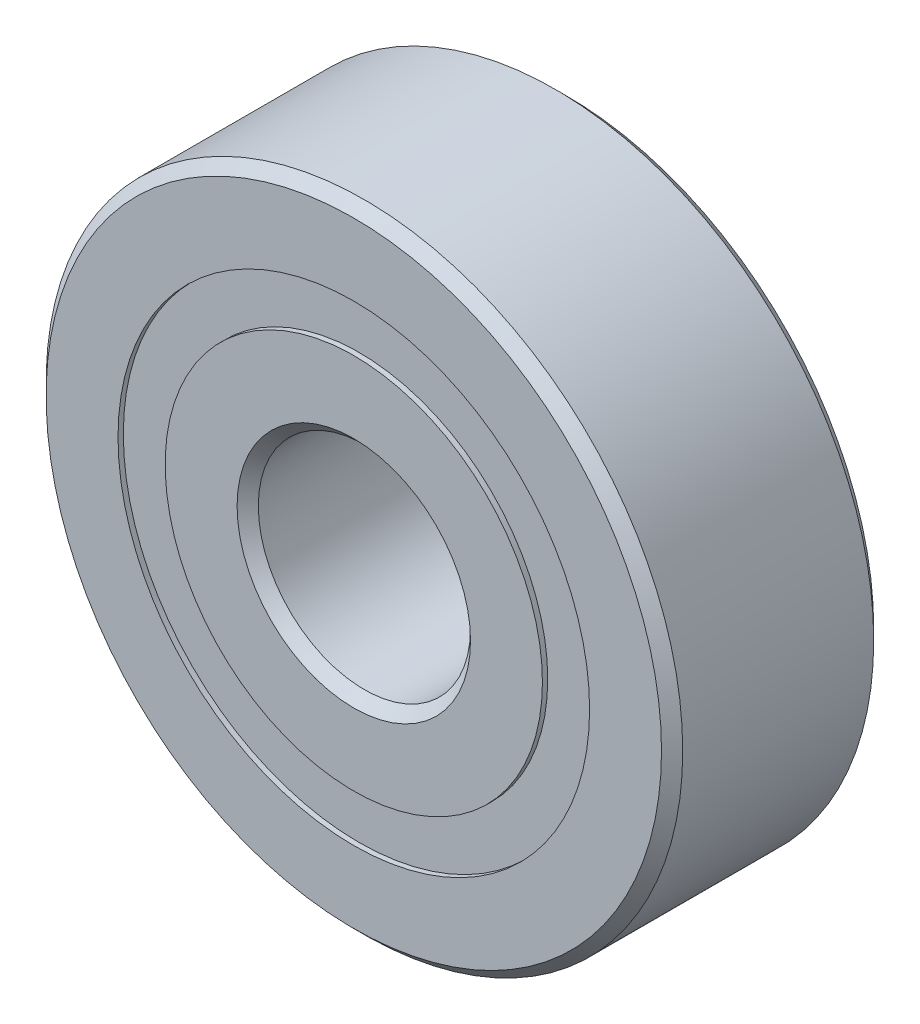
ISO-10303-21;
HEADER;
FILE_DESCRIPTION(('STEP AP214'),'2;1');
FILE_NAME('part.step','',(''),(''),'','','');
FILE_SCHEMA(('AUTOMOTIVE_DESIGN { 1 0 10303 214 1 1 1 1 }'));
ENDSEC;
DATA;
#1=APPLICATION_CONTEXT('core data for automotive mechanical design processes');
#2=APPLICATION_PROTOCOL_DEFINITION('international standard','automotive_design',2000,#1);
#3=PRODUCT_CONTEXT('',#1,'mechanical');
#4=PRODUCT('Part','Part','',(#3));
#5=PRODUCT_RELATED_PRODUCT_CATEGORY('part','',(#4));
#6=PRODUCT_DEFINITION_FORMATION('','',#4);
#7=PRODUCT_DEFINITION_CONTEXT('part definition',#1,'design');
#8=PRODUCT_DEFINITION('design','',#6,#7);
#9=PRODUCT_DEFINITION_SHAPE('','',#8);
#10=(LENGTH_UNIT() NAMED_UNIT(*) SI_UNIT(.MILLI.,.METRE.));
#11=(NAMED_UNIT(*) PLANE_ANGLE_UNIT() SI_UNIT($,.RADIAN.));
#12=(NAMED_UNIT(*) SI_UNIT($,.STERADIAN.) SOLID_ANGLE_UNIT());
#13=UNCERTAINTY_MEASURE_WITH_UNIT(LENGTH_MEASURE(1.E-05),#10,'distance_accuracy_value','');
#14=(GEOMETRIC_REPRESENTATION_CONTEXT(3) GLOBAL_UNCERTAINTY_ASSIGNED_CONTEXT((#13)) GLOBAL_UNIT_ASSIGNED_CONTEXT((#10,
#11,#12)) REPRESENTATION_CONTEXT('',''));
#15=CARTESIAN_POINT('',(0.,0.,0.));
#16=DIRECTION('',(0.,0.,1.));
#17=DIRECTION('',(1.,0.,0.));
#18=AXIS2_PLACEMENT_3D('',#15,#16,#17);
#19=CARTESIAN_POINT('',(0.,4.44444444444444,-0.993807989999908));
#20=DIRECTION('',(0.,0.,-1.));
#21=DIRECTION('',(-1.,0.,0.));
#22=AXIS2_PLACEMENT_3D('',#19,#20,#21);
#23=PLANE('',#22);
#24=CARTESIAN_POINT('',(0.,0.,-0.993807989999909));
#25=DIRECTION('',(0.,0.,1.));
#26=DIRECTION('',(1.,0.,0.));
#27=AXIS2_PLACEMENT_3D('',#24,#25,#26);
#28=CIRCLE('',#27,3.55555555555556);
#29=CARTESIAN_POINT('',(3.55555555555556,0.,-0.993807989999909));
#30=VERTEX_POINT('',#29);
#31=EDGE_CURVE('E11',#30,#30,#28,.T.);
#32=ORIENTED_EDGE('',*,*,#31,.F.);
#33=EDGE_LOOP('',(#32));
#34=FACE_BOUND('',#33,.T.);
#35=CARTESIAN_POINT('',(0.,0.,-0.993807989999908));
#36=DIRECTION('',(0.,0.,1.));
#37=DIRECTION('',(1.,0.,0.));
#38=AXIS2_PLACEMENT_3D('',#35,#36,#37);
#39=CIRCLE('',#38,4.44444444444444);
#40=CARTESIAN_POINT('',(4.44444444444444,0.,-0.993807989999908));
#41=VERTEX_POINT('',#40);
#42=EDGE_CURVE('E55',#41,#41,#39,.T.);
#43=ORIENTED_EDGE('',*,*,#42,.T.);
#44=EDGE_LOOP('',(#43));
#45=FACE_BOUND('',#44,.T.);
#46=ADVANCED_FACE('F41',(#34,#45),#23,.F.);
#47=CARTESIAN_POINT('',(0.,0.,2.));
#48=DIRECTION('',(0.,0.,1.));
#49=DIRECTION('',(1.,0.,0.));
#50=AXIS2_PLACEMENT_3D('',#47,#48,#49);
#51=CYLINDRICAL_SURFACE('',#50,3.55555555555556);
#52=CARTESIAN_POINT('',(0.,0.,-1.90000000000001));
#53=DIRECTION('',(0.,0.,1.));
#54=DIRECTION('',(1.,0.,0.));
#55=AXIS2_PLACEMENT_3D('',#52,#53,#54);
#56=CIRCLE('',#55,3.55555555555556);
#57=CARTESIAN_POINT('',(3.55555555555556,0.,-1.90000000000001));
#58=VERTEX_POINT('',#57);
#59=EDGE_CURVE('E47',#58,#58,#56,.T.);
#60=ORIENTED_EDGE('',*,*,#59,.F.);
#61=EDGE_LOOP('',(#60));
#62=FACE_BOUND('',#61,.T.);
#63=ORIENTED_EDGE('',*,*,#31,.T.);
#64=EDGE_LOOP('',(#63));
#65=FACE_BOUND('',#64,.T.);
#66=ADVANCED_FACE('F70',(#62,#65),#51,.F.);
#67=CARTESIAN_POINT('',(0.,4.44444444444444,-1.90000000000001));
#68=DIRECTION('',(0.,0.,1.));
#69=DIRECTION('',(1.,0.,0.));
#70=AXIS2_PLACEMENT_3D('',#67,#68,#69);
#71=PLANE('',#70);
#72=CARTESIAN_POINT('',(0.,0.,-1.90000000000001));
#73=DIRECTION('',(0.,0.,1.));
#74=DIRECTION('',(1.,0.,0.));
#75=AXIS2_PLACEMENT_3D('',#72,#73,#74);
#76=CIRCLE('',#75,4.44444444444444);
#77=CARTESIAN_POINT('',(4.44444444444444,0.,-1.90000000000001));
#78=VERTEX_POINT('',#77);
#79=EDGE_CURVE('E51',#78,#78,#76,.T.);
#80=ORIENTED_EDGE('',*,*,#79,.F.);
#81=EDGE_LOOP('',(#80));
#82=FACE_BOUND('',#81,.T.);
#83=ORIENTED_EDGE('',*,*,#59,.T.);
#84=EDGE_LOOP('',(#83));
#85=FACE_BOUND('',#84,.T.);
#86=ADVANCED_FACE('F65',(#82,#85),#71,.F.);
#87=CARTESIAN_POINT('',(0.,0.,2.));
#88=DIRECTION('',(0.,0.,1.));
#89=DIRECTION('',(1.,0.,0.));
#90=AXIS2_PLACEMENT_3D('',#87,#88,#89);
#91=CYLINDRICAL_SURFACE('',#90,4.44444444444444);
#92=ORIENTED_EDGE('',*,*,#42,.F.);
#93=EDGE_LOOP('',(#92));
#94=FACE_BOUND('',#93,.T.);
#95=ORIENTED_EDGE('',*,*,#79,.T.);
#96=EDGE_LOOP('',(#95));
#97=FACE_BOUND('',#96,.T.);
#98=ADVANCED_FACE('F62',(#94,#97),#91,.T.);
#99=CLOSED_SHELL('',(#46,#66,#86,#98));
#100=MANIFOLD_SOLID_BREP('B2',#99);
#101=CARTESIAN_POINT('',(0.,4.44444444444444,1.9));
#102=DIRECTION('',(0.,0.,-1.));
#103=DIRECTION('',(-1.,0.,0.));
#104=AXIS2_PLACEMENT_3D('',#101,#102,#103);
#105=PLANE('',#104);
#106=CARTESIAN_POINT('',(0.,0.,1.9));
#107=DIRECTION('',(0.,0.,1.));
#108=DIRECTION('',(1.,0.,0.));
#109=AXIS2_PLACEMENT_3D('',#106,#107,#108);
#110=CIRCLE('',#109,3.55555555555556);
#111=CARTESIAN_POINT('',(3.55555555555556,0.,1.9));
#112=VERTEX_POINT('',#111);
#113=EDGE_CURVE('E40',#112,#112,#110,.T.);
#114=ORIENTED_EDGE('',*,*,#113,.F.);
#115=EDGE_LOOP('',(#114));
#116=FACE_BOUND('',#115,.T.);
#117=CARTESIAN_POINT('',(0.,0.,1.9));
#118=DIRECTION('',(0.,0.,1.));
#119=DIRECTION('',(1.,0.,0.));
#120=AXIS2_PLACEMENT_3D('',#117,#118,#119);
#121=CIRCLE('',#120,4.44444444444444);
#122=CARTESIAN_POINT('',(4.44444444444444,0.,1.9));
#123=VERTEX_POINT('',#122);
#124=EDGE_CURVE('E122',#123,#123,#121,.T.);
#125=ORIENTED_EDGE('',*,*,#124,.T.);
#126=EDGE_LOOP('',(#125));
#127=FACE_BOUND('',#126,.T.);
#128=ADVANCED_FACE('F108',(#116,#127),#105,.F.);
#129=CARTESIAN_POINT('',(0.,0.,2.));
#130=DIRECTION('',(0.,0.,1.));
#131=DIRECTION('',(1.,0.,0.));
#132=AXIS2_PLACEMENT_3D('',#129,#130,#131);
#133=CYLINDRICAL_SURFACE('',#132,3.55555555555556);
#134=CARTESIAN_POINT('',(0.,0.,0.993807989999899));
#135=DIRECTION('',(0.,0.,1.));
#136=DIRECTION('',(1.,0.,0.));
#137=AXIS2_PLACEMENT_3D('',#134,#135,#136);
#138=CIRCLE('',#137,3.55555555555556);
#139=CARTESIAN_POINT('',(3.55555555555556,0.,0.993807989999899));
#140=VERTEX_POINT('',#139);
#141=EDGE_CURVE('E114',#140,#140,#138,.T.);
#142=ORIENTED_EDGE('',*,*,#141,.F.);
#143=EDGE_LOOP('',(#142));
#144=FACE_BOUND('',#143,.T.);
#145=ORIENTED_EDGE('',*,*,#113,.T.);
#146=EDGE_LOOP('',(#145));
#147=FACE_BOUND('',#146,.T.);
#148=ADVANCED_FACE('F137',(#144,#147),#133,.F.);
#149=CARTESIAN_POINT('',(0.,4.44444444444444,0.993807989999899));
#150=DIRECTION('',(0.,0.,1.));
#151=DIRECTION('',(1.,0.,0.));
#152=AXIS2_PLACEMENT_3D('',#149,#150,#151);
#153=PLANE('',#152);
#154=CARTESIAN_POINT('',(0.,0.,0.993807989999899));
#155=DIRECTION('',(0.,0.,1.));
#156=DIRECTION('',(1.,0.,0.));
#157=AXIS2_PLACEMENT_3D('',#154,#155,#156);
#158=CIRCLE('',#157,4.44444444444444);
#159=CARTESIAN_POINT('',(4.44444444444444,0.,0.993807989999899));
#160=VERTEX_POINT('',#159);
#161=EDGE_CURVE('E118',#160,#160,#158,.T.);
#162=ORIENTED_EDGE('',*,*,#161,.F.);
#163=EDGE_LOOP('',(#162));
#164=FACE_BOUND('',#163,.T.);
#165=ORIENTED_EDGE('',*,*,#141,.T.);
#166=EDGE_LOOP('',(#165));
#167=FACE_BOUND('',#166,.T.);
#168=ADVANCED_FACE('F132',(#164,#167),#153,.F.);
#169=CARTESIAN_POINT('',(0.,0.,2.));
#170=DIRECTION('',(0.,0.,1.));
#171=DIRECTION('',(1.,0.,0.));
#172=AXIS2_PLACEMENT_3D('',#169,#170,#171);
#173=CYLINDRICAL_SURFACE('',#172,4.44444444444444);
#174=ORIENTED_EDGE('',*,*,#124,.F.);
#175=EDGE_LOOP('',(#174));
#176=FACE_BOUND('',#175,.T.);
#177=ORIENTED_EDGE('',*,*,#161,.T.);
#178=EDGE_LOOP('',(#177));
#179=FACE_BOUND('',#178,.T.);
#180=ADVANCED_FACE('F129',(#176,#179),#173,.T.);
#181=CLOSED_SHELL('',(#128,#148,#168,#180));
#182=MANIFOLD_SOLID_BREP('B6',#181);
#183=CARTESIAN_POINT('',(-1.99999999999996,3.46410161513778,0.));
#184=DIRECTION('',(0.,0.,1.));
#185=DIRECTION('',(-0.499999999999989,0.866025403784445,0.));
#186=AXIS2_PLACEMENT_3D('',#183,#184,#185);
#187=SPHERICAL_SURFACE('',#186,0.993807989999899);
#188=CARTESIAN_POINT('',(-1.99999999999996,3.46410161513778,0.993807989999896));
#189=VERTEX_POINT('',#188);
#190=VERTEX_LOOP('',#189);
#191=FACE_BOUND('',#190,.T.);
#192=ADVANCED_FACE('F175',(#191),#187,.T.);
#193=CLOSED_SHELL('',(#192));
#194=MANIFOLD_SOLID_BREP('B35',#193);
#195=CARTESIAN_POINT('',(-3.46410161513773,2.00000000000004,0.));
#196=DIRECTION('',(0.,0.,1.));
#197=DIRECTION('',(-0.866025403784433,0.50000000000001,0.));
#198=AXIS2_PLACEMENT_3D('',#195,#196,#197);
#199=SPHERICAL_SURFACE('',#198,0.993807989999899);
#200=CARTESIAN_POINT('',(-3.46410161513773,2.00000000000004,0.993807989999896));
#201=VERTEX_POINT('',#200);
#202=VERTEX_LOOP('',#201);
#203=FACE_BOUND('',#202,.T.);
#204=ADVANCED_FACE('F206',(#203),#199,.T.);
#205=CLOSED_SHELL('',(#204));
#206=MANIFOLD_SOLID_BREP('B104',#205);
#207=CARTESIAN_POINT('',(-4.,0.,0.));
#208=DIRECTION('',(0.,0.,1.));
#209=DIRECTION('',(-1.,0.,0.));
#210=AXIS2_PLACEMENT_3D('',#207,#208,#209);
#211=SPHERICAL_SURFACE('',#210,0.993807989999899);
#212=CARTESIAN_POINT('',(-4.,0.,0.993807989999896));
#213=VERTEX_POINT('',#212);
#214=VERTEX_LOOP('',#213);
#215=FACE_BOUND('',#214,.T.);
#216=ADVANCED_FACE('F237',(#215),#211,.T.);
#217=CLOSED_SHELL('',(#216));
#218=MANIFOLD_SOLID_BREP('B171',#217);
#219=CARTESIAN_POINT('',(-3.46410161513777,-1.99999999999997,0.));
#220=DIRECTION('',(0.,0.,1.));
#221=DIRECTION('',(-0.866025403784443,-0.499999999999992,0.));
#222=AXIS2_PLACEMENT_3D('',#219,#220,#221);
#223=SPHERICAL_SURFACE('',#222,0.993807989999899);
#224=CARTESIAN_POINT('',(-3.46410161513777,-1.99999999999997,0.993807989999896));
#225=VERTEX_POINT('',#224);
#226=VERTEX_LOOP('',#225);
#227=FACE_BOUND('',#226,.T.);
#228=ADVANCED_FACE('F268',(#227),#223,.T.);
#229=CLOSED_SHELL('',(#228));
#230=MANIFOLD_SOLID_BREP('B202',#229);
#231=CARTESIAN_POINT('',(-2.00000000000003,-3.46410161513774,0.));
#232=DIRECTION('',(0.,0.,1.));
#233=DIRECTION('',(-0.500000000000007,-0.866025403784435,0.));
#234=AXIS2_PLACEMENT_3D('',#231,#232,#233);
#235=SPHERICAL_SURFACE('',#234,0.993807989999899);
#236=CARTESIAN_POINT('',(-2.00000000000003,-3.46410161513774,0.993807989999896));
#237=VERTEX_POINT('',#236);
#238=VERTEX_LOOP('',#237);
#239=FACE_BOUND('',#238,.T.);
#240=ADVANCED_FACE('F299',(#239),#235,.T.);
#241=CLOSED_SHELL('',(#240));
#242=MANIFOLD_SOLID_BREP('B233',#241);
#243=CARTESIAN_POINT('',(0.,-4.,0.));
#244=DIRECTION('',(0.,0.,1.));
#245=DIRECTION('',(0.,-1.,0.));
#246=AXIS2_PLACEMENT_3D('',#243,#244,#245);
#247=SPHERICAL_SURFACE('',#246,0.993807989999899);
#248=CARTESIAN_POINT('',(0.,-4.,0.993807989999896));
#249=VERTEX_POINT('',#248);
#250=VERTEX_LOOP('',#249);
#251=FACE_BOUND('',#250,.T.);
#252=ADVANCED_FACE('F330',(#251),#247,.T.);
#253=CLOSED_SHELL('',(#252));
#254=MANIFOLD_SOLID_BREP('B264',#253);
#255=CARTESIAN_POINT('',(1.99999999999998,-3.46410161513777,0.));
#256=DIRECTION('',(0.,0.,1.));
#257=DIRECTION('',(0.499999999999995,-0.866025403784442,0.));
#258=AXIS2_PLACEMENT_3D('',#255,#256,#257);
#259=SPHERICAL_SURFACE('',#258,0.993807989999899);
#260=CARTESIAN_POINT('',(1.99999999999998,-3.46410161513777,0.993807989999896));
#261=VERTEX_POINT('',#260);
#262=VERTEX_LOOP('',#261);
#263=FACE_BOUND('',#262,.T.);
#264=ADVANCED_FACE('F361',(#263),#259,.T.);
#265=CLOSED_SHELL('',(#264));
#266=MANIFOLD_SOLID_BREP('B295',#265);
#267=CARTESIAN_POINT('',(3.46410161513775,-2.00000000000002,0.));
#268=DIRECTION('',(0.,0.,1.));
#269=DIRECTION('',(0.866025403784436,-0.500000000000004,0.));
#270=AXIS2_PLACEMENT_3D('',#267,#268,#269);
#271=SPHERICAL_SURFACE('',#270,0.993807989999899);
#272=CARTESIAN_POINT('',(3.46410161513775,-2.00000000000002,0.993807989999896));
#273=VERTEX_POINT('',#272);
#274=VERTEX_LOOP('',#273);
#275=FACE_BOUND('',#274,.T.);
#276=ADVANCED_FACE('F392',(#275),#271,.T.);
#277=CLOSED_SHELL('',(#276));
#278=MANIFOLD_SOLID_BREP('B326',#277);
#279=CARTESIAN_POINT('',(4.,0.,0.));
#280=DIRECTION('',(0.,0.,1.));
#281=DIRECTION('',(1.,0.,0.));
#282=AXIS2_PLACEMENT_3D('',#279,#280,#281);
#283=SPHERICAL_SURFACE('',#282,0.993807989999899);
#284=CARTESIAN_POINT('',(4.,0.,0.993807989999896));
#285=VERTEX_POINT('',#284);
#286=VERTEX_LOOP('',#285);
#287=FACE_BOUND('',#286,.T.);
#288=ADVANCED_FACE('F423',(#287),#283,.T.);
#289=CLOSED_SHELL('',(#288));
#290=MANIFOLD_SOLID_BREP('B357',#289);
#291=CARTESIAN_POINT('',(3.46410161513776,1.99999999999999,0.));
#292=DIRECTION('',(0.,0.,1.));
#293=DIRECTION('',(0.86602540378444,0.499999999999998,0.));
#294=AXIS2_PLACEMENT_3D('',#291,#292,#293);
#295=SPHERICAL_SURFACE('',#294,0.993807989999899);
#296=CARTESIAN_POINT('',(3.46410161513776,1.99999999999999,0.993807989999896));
#297=VERTEX_POINT('',#296);
#298=VERTEX_LOOP('',#297);
#299=FACE_BOUND('',#298,.T.);
#300=ADVANCED_FACE('F454',(#299),#295,.T.);
#301=CLOSED_SHELL('',(#300));
#302=MANIFOLD_SOLID_BREP('B388',#301);
#303=CARTESIAN_POINT('',(2.,3.46410161513775,0.));
#304=DIRECTION('',(0.,0.,1.));
#305=DIRECTION('',(0.500000000000001,0.866025403784438,0.));
#306=AXIS2_PLACEMENT_3D('',#303,#304,#305);
#307=SPHERICAL_SURFACE('',#306,0.993807989999899);
#308=CARTESIAN_POINT('',(2.,3.46410161513775,0.993807989999896));
#309=VERTEX_POINT('',#308);
#310=VERTEX_LOOP('',#309);
#311=FACE_BOUND('',#310,.T.);
#312=ADVANCED_FACE('F485',(#311),#307,.T.);
#313=CLOSED_SHELL('',(#312));
#314=MANIFOLD_SOLID_BREP('B419',#313);
#315=CARTESIAN_POINT('',(0.,4.,0.));
#316=DIRECTION('',(0.,0.,1.));
#317=DIRECTION('',(0.,1.,0.));
#318=AXIS2_PLACEMENT_3D('',#315,#316,#317);
#319=SPHERICAL_SURFACE('',#318,0.993807989999899);
#320=CARTESIAN_POINT('',(0.,4.,0.993807989999896));
#321=VERTEX_POINT('',#320);
#322=VERTEX_LOOP('',#321);
#323=FACE_BOUND('',#322,.T.);
#324=ADVANCED_FACE('F518',(#323),#319,.T.);
#325=CLOSED_SHELL('',(#324));
#326=MANIFOLD_SOLID_BREP('B450',#325);
#327=CARTESIAN_POINT('',(0.,3.55555555555556,2.));
#328=DIRECTION('',(0.,0.,-1.));
#329=DIRECTION('',(-1.,0.,0.));
#330=AXIS2_PLACEMENT_3D('',#327,#328,#329);
#331=PLANE('',#330);
#332=CARTESIAN_POINT('',(0.,0.,2.));
#333=DIRECTION('',(0.,0.,1.));
#334=DIRECTION('',(1.,0.,0.));
#335=AXIS2_PLACEMENT_3D('',#332,#333,#334);
#336=CIRCLE('',#335,2.2);
#337=CARTESIAN_POINT('',(2.2,0.,2.));
#338=VERTEX_POINT('',#337);
#339=EDGE_CURVE('E517',#338,#338,#336,.T.);
#340=ORIENTED_EDGE('',*,*,#339,.F.);
#341=EDGE_LOOP('',(#340));
#342=FACE_BOUND('',#341,.T.);
#343=CARTESIAN_POINT('',(0.,0.,2.));
#344=DIRECTION('',(0.,0.,1.));
#345=DIRECTION('',(1.,0.,0.));
#346=AXIS2_PLACEMENT_3D('',#343,#344,#345);
#347=CIRCLE('',#346,3.55555555555556);
#348=CARTESIAN_POINT('',(3.55555555555556,0.,2.));
#349=VERTEX_POINT('',#348);
#350=EDGE_CURVE('E565',#349,#349,#347,.T.);
#351=ORIENTED_EDGE('',*,*,#350,.T.);
#352=EDGE_LOOP('',(#351));
#353=FACE_BOUND('',#352,.T.);
#354=ADVANCED_FACE('F537',(#342,#353),#331,.F.);
#355=CARTESIAN_POINT('',(0.,0.,2.));
#356=DIRECTION('',(0.,0.,1.));
#357=DIRECTION('',(1.,0.,0.));
#358=AXIS2_PLACEMENT_3D('',#355,#356,#357);
#359=CONICAL_SURFACE('',#358,2.2,0.785398163397448);
#360=CARTESIAN_POINT('',(0.,0.,1.8));
#361=DIRECTION('',(0.,0.,1.));
#362=DIRECTION('',(1.,0.,0.));
#363=AXIS2_PLACEMENT_3D('',#360,#361,#362);
#364=CIRCLE('',#363,2.);
#365=CARTESIAN_POINT('',(2.,0.,1.8));
#366=VERTEX_POINT('',#365);
#367=EDGE_CURVE('E543',#366,#366,#364,.T.);
#368=ORIENTED_EDGE('',*,*,#367,.F.);
#369=EDGE_LOOP('',(#368));
#370=FACE_BOUND('',#369,.T.);
#371=ORIENTED_EDGE('',*,*,#339,.T.);
#372=EDGE_LOOP('',(#371));
#373=FACE_BOUND('',#372,.T.);
#374=ADVANCED_FACE('F602',(#370,#373),#359,.F.);
#375=CARTESIAN_POINT('',(0.,0.,2.));
#376=DIRECTION('',(0.,0.,1.));
#377=DIRECTION('',(1.,0.,0.));
#378=AXIS2_PLACEMENT_3D('',#375,#376,#377);
#379=CYLINDRICAL_SURFACE('',#378,2.);
#380=CARTESIAN_POINT('',(0.,0.,-1.8));
#381=DIRECTION('',(0.,0.,1.));
#382=DIRECTION('',(1.,0.,0.));
#383=AXIS2_PLACEMENT_3D('',#380,#381,#382);
#384=CIRCLE('',#383,2.);
#385=CARTESIAN_POINT('',(2.,0.,-1.8));
#386=VERTEX_POINT('',#385);
#387=EDGE_CURVE('E547',#386,#386,#384,.T.);
#388=ORIENTED_EDGE('',*,*,#387,.F.);
#389=EDGE_LOOP('',(#388));
#390=FACE_BOUND('',#389,.T.);
#391=ORIENTED_EDGE('',*,*,#367,.T.);
#392=EDGE_LOOP('',(#391));
#393=FACE_BOUND('',#392,.T.);
#394=ADVANCED_FACE('F597',(#390,#393),#379,.F.);
#395=CARTESIAN_POINT('',(0.,0.,-1.8));
#396=DIRECTION('',(0.,0.,-1.));
#397=DIRECTION('',(-1.,0.,0.));
#398=AXIS2_PLACEMENT_3D('',#395,#396,#397);
#399=CONICAL_SURFACE('',#398,2.,0.785398163397448);
#400=CARTESIAN_POINT('',(0.,0.,-2.));
#401=DIRECTION('',(0.,0.,1.));
#402=DIRECTION('',(1.,0.,0.));
#403=AXIS2_PLACEMENT_3D('',#400,#401,#402);
#404=CIRCLE('',#403,2.2);
#405=CARTESIAN_POINT('',(2.2,0.,-2.));
#406=VERTEX_POINT('',#405);
#407=EDGE_CURVE('E551',#406,#406,#404,.T.);
#408=ORIENTED_EDGE('',*,*,#407,.F.);
#409=EDGE_LOOP('',(#408));
#410=FACE_BOUND('',#409,.T.);
#411=ORIENTED_EDGE('',*,*,#387,.T.);
#412=EDGE_LOOP('',(#411));
#413=FACE_BOUND('',#412,.T.);
#414=ADVANCED_FACE('F591',(#410,#413),#399,.F.);
#415=CARTESIAN_POINT('',(0.,3.55555555555556,-2.));
#416=DIRECTION('',(0.,0.,1.));
#417=DIRECTION('',(1.,0.,0.));
#418=AXIS2_PLACEMENT_3D('',#415,#416,#417);
#419=PLANE('',#418);
#420=CARTESIAN_POINT('',(0.,0.,-2.00000000000001));
#421=DIRECTION('',(0.,0.,1.));
#422=DIRECTION('',(1.,0.,0.));
#423=AXIS2_PLACEMENT_3D('',#420,#421,#422);
#424=CIRCLE('',#423,3.55555555555556);
#425=CARTESIAN_POINT('',(3.55555555555556,0.,-2.00000000000001));
#426=VERTEX_POINT('',#425);
#427=EDGE_CURVE('E556',#426,#426,#424,.T.);
#428=ORIENTED_EDGE('',*,*,#427,.F.);
#429=EDGE_LOOP('',(#428));
#430=FACE_BOUND('',#429,.T.);
#431=ORIENTED_EDGE('',*,*,#407,.T.);
#432=EDGE_LOOP('',(#431));
#433=FACE_BOUND('',#432,.T.);
#434=ADVANCED_FACE('F585',(#430,#433),#419,.F.);
#435=CARTESIAN_POINT('',(0.,0.,2.));
#436=DIRECTION('',(0.,0.,1.));
#437=DIRECTION('',(1.,0.,0.));
#438=AXIS2_PLACEMENT_3D('',#435,#436,#437);
#439=CYLINDRICAL_SURFACE('',#438,3.55555555555556);
#440=CARTESIAN_POINT('',(0.,0.,-0.88888888888889));
#441=DIRECTION('',(0.,0.,1.));
#442=DIRECTION('',(1.,0.,0.));
#443=AXIS2_PLACEMENT_3D('',#440,#441,#442);
#444=CIRCLE('',#443,3.55555555555556);
#445=CARTESIAN_POINT('',(3.55555555555556,0.,-0.88888888888889));
#446=VERTEX_POINT('',#445);
#447=EDGE_CURVE('E559',#446,#446,#444,.T.);
#448=ORIENTED_EDGE('',*,*,#447,.F.);
#449=EDGE_LOOP('',(#448));
#450=FACE_BOUND('',#449,.T.);
#451=ORIENTED_EDGE('',*,*,#427,.T.);
#452=EDGE_LOOP('',(#451));
#453=FACE_BOUND('',#452,.T.);
#454=ADVANCED_FACE('F579',(#450,#453),#439,.T.);
#455=CARTESIAN_POINT('',(0.,0.,0.));
#456=DIRECTION('',(0.,0.,1.));
#457=DIRECTION('',(1.,0.,0.));
#458=AXIS2_PLACEMENT_3D('',#455,#456,#457);
#459=TOROIDAL_SURFACE('',#458,4.,0.993807989999902);
#460=CARTESIAN_POINT('',(0.,0.,0.888888888888885));
#461=DIRECTION('',(0.,0.,1.));
#462=DIRECTION('',(1.,0.,0.));
#463=AXIS2_PLACEMENT_3D('',#460,#461,#462);
#464=CIRCLE('',#463,3.55555555555556);
#465=CARTESIAN_POINT('',(3.55555555555556,0.,0.888888888888885));
#466=VERTEX_POINT('',#465);
#467=EDGE_CURVE('E562',#466,#466,#464,.T.);
#468=ORIENTED_EDGE('',*,*,#467,.F.);
#469=EDGE_LOOP('',(#468));
#470=FACE_BOUND('',#469,.T.);
#471=ORIENTED_EDGE('',*,*,#447,.T.);
#472=EDGE_LOOP('',(#471));
#473=FACE_BOUND('',#472,.T.);
#474=ADVANCED_FACE('F573',(#470,#473),#459,.F.);
#475=CARTESIAN_POINT('',(0.,0.,2.));
#476=DIRECTION('',(0.,0.,1.));
#477=DIRECTION('',(1.,0.,0.));
#478=AXIS2_PLACEMENT_3D('',#475,#476,#477);
#479=CYLINDRICAL_SURFACE('',#478,3.55555555555556);
#480=ORIENTED_EDGE('',*,*,#350,.F.);
#481=EDGE_LOOP('',(#480));
#482=FACE_BOUND('',#481,.T.);
#483=ORIENTED_EDGE('',*,*,#467,.T.);
#484=EDGE_LOOP('',(#483));
#485=FACE_BOUND('',#484,.T.);
#486=ADVANCED_FACE('F570',(#482,#485),#479,.T.);
#487=CLOSED_SHELL('',(#354,#374,#394,#414,#434,#454,#474,#486));
#488=MANIFOLD_SOLID_BREP('B481',#487);
#489=CARTESIAN_POINT('',(0.,0.,1.8));
#490=DIRECTION('',(0.,0.,-1.));
#491=DIRECTION('',(-1.,0.,0.));
#492=AXIS2_PLACEMENT_3D('',#489,#490,#491);
#493=CONICAL_SURFACE('',#492,6.,0.785398163397446);
#494=CARTESIAN_POINT('',(0.,0.,2.));
#495=DIRECTION('',(0.,0.,1.));
#496=DIRECTION('',(1.,0.,0.));
#497=AXIS2_PLACEMENT_3D('',#494,#495,#496);
#498=CIRCLE('',#497,5.8);
#499=CARTESIAN_POINT('',(5.8,0.,2.));
#500=VERTEX_POINT('',#499);
#501=EDGE_CURVE('E686',#500,#500,#498,.T.);
#502=ORIENTED_EDGE('',*,*,#501,.F.);
#503=EDGE_LOOP('',(#502));
#504=FACE_BOUND('',#503,.T.);
#505=CARTESIAN_POINT('',(0.,0.,1.8));
#506=DIRECTION('',(0.,0.,1.));
#507=DIRECTION('',(1.,0.,0.));
#508=AXIS2_PLACEMENT_3D('',#505,#506,#507);
#509=CIRCLE('',#508,6.);
#510=CARTESIAN_POINT('',(6.,0.,1.8));
#511=VERTEX_POINT('',#510);
#512=EDGE_CURVE('E536',#511,#511,#509,.T.);
#513=ORIENTED_EDGE('',*,*,#512,.T.);
#514=EDGE_LOOP('',(#513));
#515=FACE_BOUND('',#514,.T.);
#516=ADVANCED_FACE('F658',(#504,#515),#493,.T.);
#517=CARTESIAN_POINT('',(0.,0.,2.));
#518=DIRECTION('',(0.,0.,1.));
#519=DIRECTION('',(1.,0.,0.));
#520=AXIS2_PLACEMENT_3D('',#517,#518,#519);
#521=CYLINDRICAL_SURFACE('',#520,6.);
#522=ORIENTED_EDGE('',*,*,#512,.F.);
#523=EDGE_LOOP('',(#522));
#524=FACE_BOUND('',#523,.T.);
#525=CARTESIAN_POINT('',(0.,0.,-1.80000000000001));
#526=DIRECTION('',(0.,0.,1.));
#527=DIRECTION('',(1.,0.,0.));
#528=AXIS2_PLACEMENT_3D('',#525,#526,#527);
#529=CIRCLE('',#528,6.);
#530=CARTESIAN_POINT('',(6.,0.,-1.80000000000001));
#531=VERTEX_POINT('',#530);
#532=EDGE_CURVE('E664',#531,#531,#529,.T.);
#533=ORIENTED_EDGE('',*,*,#532,.T.);
#534=EDGE_LOOP('',(#533));
#535=FACE_BOUND('',#534,.T.);
#536=ADVANCED_FACE('F693',(#524,#535),#521,.T.);
#537=CARTESIAN_POINT('',(0.,0.,-2.00000000000001));
#538=DIRECTION('',(0.,0.,1.));
#539=DIRECTION('',(1.,0.,0.));
#540=AXIS2_PLACEMENT_3D('',#537,#538,#539);
#541=CONICAL_SURFACE('',#540,5.8,0.785398163397446);
#542=ORIENTED_EDGE('',*,*,#532,.F.);
#543=EDGE_LOOP('',(#542));
#544=FACE_BOUND('',#543,.T.);
#545=CARTESIAN_POINT('',(0.,0.,-2.00000000000001));
#546=DIRECTION('',(0.,0.,1.));
#547=DIRECTION('',(1.,0.,0.));
#548=AXIS2_PLACEMENT_3D('',#545,#546,#547);
#549=CIRCLE('',#548,5.8);
#550=CARTESIAN_POINT('',(5.8,0.,-2.00000000000001));
#551=VERTEX_POINT('',#550);
#552=EDGE_CURVE('E668',#551,#551,#549,.T.);
#553=ORIENTED_EDGE('',*,*,#552,.T.);
#554=EDGE_LOOP('',(#553));
#555=FACE_BOUND('',#554,.T.);
#556=ADVANCED_FACE('F697',(#544,#555),#541,.T.);
#557=CARTESIAN_POINT('',(0.,5.8,-2.00000000000001));
#558=DIRECTION('',(0.,0.,1.));
#559=DIRECTION('',(1.,0.,0.));
#560=AXIS2_PLACEMENT_3D('',#557,#558,#559);
#561=PLANE('',#560);
#562=ORIENTED_EDGE('',*,*,#552,.F.);
#563=EDGE_LOOP('',(#562));
#564=FACE_BOUND('',#563,.T.);
#565=CARTESIAN_POINT('',(0.,0.,-2.00000000000001));
#566=DIRECTION('',(0.,0.,1.));
#567=DIRECTION('',(1.,0.,0.));
#568=AXIS2_PLACEMENT_3D('',#565,#566,#567);
#569=CIRCLE('',#568,4.44444444444444);
#570=CARTESIAN_POINT('',(4.44444444444444,0.,-2.00000000000001));
#571=VERTEX_POINT('',#570);
#572=EDGE_CURVE('E672',#571,#571,#569,.T.);
#573=ORIENTED_EDGE('',*,*,#572,.T.);
#574=EDGE_LOOP('',(#573));
#575=FACE_BOUND('',#574,.T.);
#576=ADVANCED_FACE('F702',(#564,#575),#561,.F.);
#577=CARTESIAN_POINT('',(0.,0.,2.));
#578=DIRECTION('',(0.,0.,1.));
#579=DIRECTION('',(1.,0.,0.));
#580=AXIS2_PLACEMENT_3D('',#577,#578,#579);
#581=CYLINDRICAL_SURFACE('',#580,4.44444444444444);
#582=ORIENTED_EDGE('',*,*,#572,.F.);
#583=EDGE_LOOP('',(#582));
#584=FACE_BOUND('',#583,.T.);
#585=CARTESIAN_POINT('',(0.,0.,-0.888888888888893));
#586=DIRECTION('',(0.,0.,1.));
#587=DIRECTION('',(1.,0.,0.));
#588=AXIS2_PLACEMENT_3D('',#585,#586,#587);
#589=CIRCLE('',#588,4.44444444444444);
#590=CARTESIAN_POINT('',(4.44444444444444,0.,-0.888888888888893));
#591=VERTEX_POINT('',#590);
#592=EDGE_CURVE('E677',#591,#591,#589,.T.);
#593=ORIENTED_EDGE('',*,*,#592,.T.);
#594=EDGE_LOOP('',(#593));
#595=FACE_BOUND('',#594,.T.);
#596=ADVANCED_FACE('F708',(#584,#595),#581,.F.);
#597=CARTESIAN_POINT('',(0.,0.,0.));
#598=DIRECTION('',(0.,0.,1.));
#599=DIRECTION('',(1.,0.,0.));
#600=AXIS2_PLACEMENT_3D('',#597,#598,#599);
#601=TOROIDAL_SURFACE('',#600,4.,0.993807989999904);
#602=ORIENTED_EDGE('',*,*,#592,.F.);
#603=EDGE_LOOP('',(#602));
#604=FACE_BOUND('',#603,.T.);
#605=CARTESIAN_POINT('',(0.,0.,0.888888888888885));
#606=DIRECTION('',(0.,0.,1.));
#607=DIRECTION('',(1.,0.,0.));
#608=AXIS2_PLACEMENT_3D('',#605,#606,#607);
#609=CIRCLE('',#608,4.44444444444444);
#610=CARTESIAN_POINT('',(4.44444444444444,0.,0.888888888888885));
#611=VERTEX_POINT('',#610);
#612=EDGE_CURVE('E680',#611,#611,#609,.T.);
#613=ORIENTED_EDGE('',*,*,#612,.T.);
#614=EDGE_LOOP('',(#613));
#615=FACE_BOUND('',#614,.T.);
#616=ADVANCED_FACE('F712',(#604,#615),#601,.F.);
#617=CARTESIAN_POINT('',(0.,0.,2.));
#618=DIRECTION('',(0.,0.,1.));
#619=DIRECTION('',(1.,0.,0.));
#620=AXIS2_PLACEMENT_3D('',#617,#618,#619);
#621=CYLINDRICAL_SURFACE('',#620,4.44444444444444);
#622=ORIENTED_EDGE('',*,*,#612,.F.);
#623=EDGE_LOOP('',(#622));
#624=FACE_BOUND('',#623,.T.);
#625=CARTESIAN_POINT('',(0.,0.,2.));
#626=DIRECTION('',(0.,0.,1.));
#627=DIRECTION('',(1.,0.,0.));
#628=AXIS2_PLACEMENT_3D('',#625,#626,#627);
#629=CIRCLE('',#628,4.44444444444444);
#630=CARTESIAN_POINT('',(4.44444444444444,0.,2.));
#631=VERTEX_POINT('',#630);
#632=EDGE_CURVE('E683',#631,#631,#629,.T.);
#633=ORIENTED_EDGE('',*,*,#632,.T.);
#634=EDGE_LOOP('',(#633));
#635=FACE_BOUND('',#634,.T.);
#636=ADVANCED_FACE('F716',(#624,#635),#621,.F.);
#637=CARTESIAN_POINT('',(0.,5.8,2.));
#638=DIRECTION('',(0.,0.,-1.));
#639=DIRECTION('',(-1.,0.,0.));
#640=AXIS2_PLACEMENT_3D('',#637,#638,#639);
#641=PLANE('',#640);
#642=ORIENTED_EDGE('',*,*,#632,.F.);
#643=EDGE_LOOP('',(#642));
#644=FACE_BOUND('',#643,.T.);
#645=ORIENTED_EDGE('',*,*,#501,.T.);
#646=EDGE_LOOP('',(#645));
#647=FACE_BOUND('',#646,.T.);
#648=ADVANCED_FACE('F690',(#644,#647),#641,.F.);
#649=CLOSED_SHELL('',(#516,#536,#556,#576,#596,#616,#636,#648));
#650=MANIFOLD_SOLID_BREP('B512',#649);
#651=ADVANCED_BREP_SHAPE_REPRESENTATION('',(#18,#100,#182,#194,#206,#218,#230,#242,#254,#266,
#278,#290,#302,#314,#326,#488,#650),#14);
#652=SHAPE_DEFINITION_REPRESENTATION(#9,#651);
ENDSEC;
END-ISO-10303-21;
